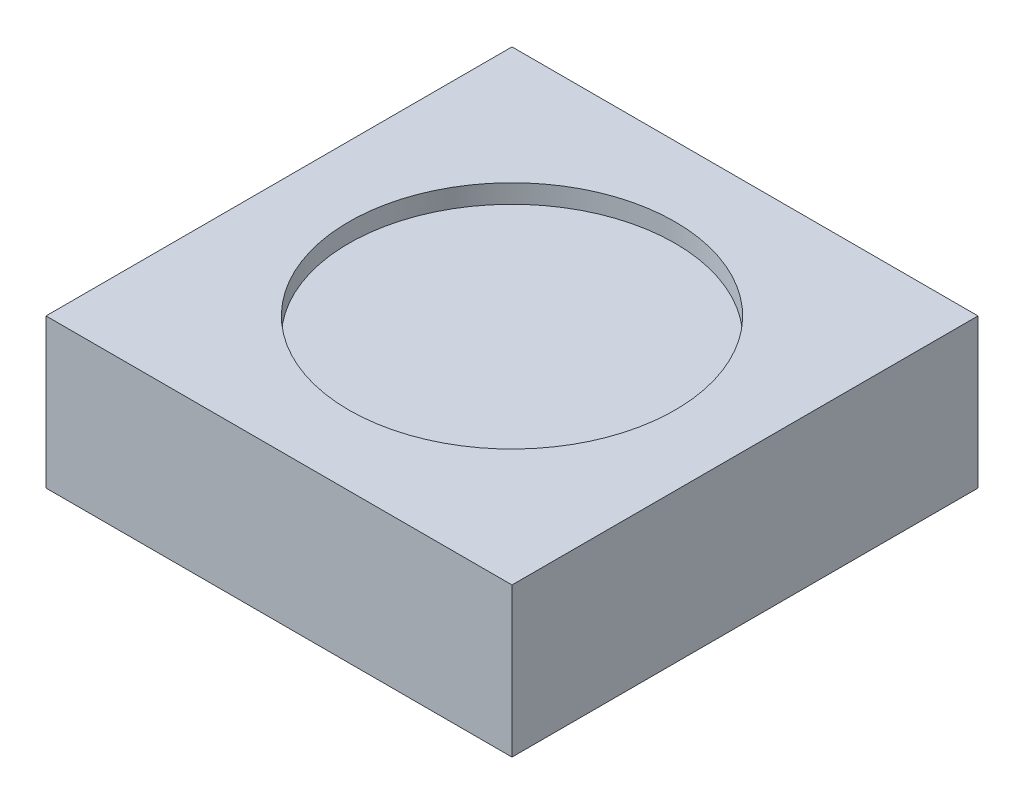
ISO-10303-21;
HEADER;
FILE_DESCRIPTION(('STEP AP214'),'2;1');
FILE_NAME('part.step','',(''),(''),'','','');
FILE_SCHEMA(('AUTOMOTIVE_DESIGN { 1 0 10303 214 1 1 1 1 }'));
ENDSEC;
DATA;
#1=APPLICATION_CONTEXT('core data for automotive mechanical design processes');
#2=APPLICATION_PROTOCOL_DEFINITION('international standard','automotive_design',2000,#1);
#3=PRODUCT_CONTEXT('',#1,'mechanical');
#4=PRODUCT('Part','Part','',(#3));
#5=PRODUCT_RELATED_PRODUCT_CATEGORY('part','',(#4));
#6=PRODUCT_DEFINITION_FORMATION('','',#4);
#7=PRODUCT_DEFINITION_CONTEXT('part definition',#1,'design');
#8=PRODUCT_DEFINITION('design','',#6,#7);
#9=PRODUCT_DEFINITION_SHAPE('','',#8);
#10=(LENGTH_UNIT() NAMED_UNIT(*) SI_UNIT(.MILLI.,.METRE.));
#11=(NAMED_UNIT(*) PLANE_ANGLE_UNIT() SI_UNIT($,.RADIAN.));
#12=(NAMED_UNIT(*) SI_UNIT($,.STERADIAN.) SOLID_ANGLE_UNIT());
#13=UNCERTAINTY_MEASURE_WITH_UNIT(LENGTH_MEASURE(1.E-05),#10,'distance_accuracy_value','');
#14=(GEOMETRIC_REPRESENTATION_CONTEXT(3) GLOBAL_UNCERTAINTY_ASSIGNED_CONTEXT((#13)) GLOBAL_UNIT_ASSIGNED_CONTEXT((#10,
#11,#12)) REPRESENTATION_CONTEXT('',''));
#15=CARTESIAN_POINT('',(0.,0.,0.));
#16=DIRECTION('',(0.,0.,1.));
#17=DIRECTION('',(1.,0.,0.));
#18=AXIS2_PLACEMENT_3D('',#15,#16,#17);
#19=CARTESIAN_POINT('',(2.5,1.6,2.5));
#20=DIRECTION('',(-1.,0.,0.));
#21=DIRECTION('',(0.,0.,1.));
#22=AXIS2_PLACEMENT_3D('',#19,#20,#21);
#23=PLANE('',#22);
#24=DIRECTION('',(0.,0.,-1.));
#25=VECTOR('',#24,1.);
#26=CARTESIAN_POINT('',(2.5,0.,2.5));
#27=LINE('',#26,#25);
#28=CARTESIAN_POINT('',(2.5,0.,2.5));
#29=VERTEX_POINT('',#28);
#30=CARTESIAN_POINT('',(2.5,0.,-2.5));
#31=VERTEX_POINT('',#30);
#32=EDGE_CURVE('E107',#29,#31,#27,.T.);
#33=ORIENTED_EDGE('',*,*,#32,.T.);
#34=DIRECTION('',(0.,-1.,0.));
#35=VECTOR('',#34,1.);
#36=CARTESIAN_POINT('',(2.5,1.6,-2.5));
#37=LINE('',#36,#35);
#38=CARTESIAN_POINT('',(2.5,1.6,-2.5));
#39=VERTEX_POINT('',#38);
#40=EDGE_CURVE('E11',#39,#31,#37,.T.);
#41=ORIENTED_EDGE('',*,*,#40,.F.);
#42=DIRECTION('',(0.,0.,-1.));
#43=VECTOR('',#42,1.);
#44=CARTESIAN_POINT('',(2.5,1.6,2.5));
#45=LINE('',#44,#43);
#46=CARTESIAN_POINT('',(2.5,1.6,2.5));
#47=VERTEX_POINT('',#46);
#48=EDGE_CURVE('E91',#47,#39,#45,.T.);
#49=ORIENTED_EDGE('',*,*,#48,.F.);
#50=DIRECTION('',(0.,-1.,0.));
#51=VECTOR('',#50,1.);
#52=CARTESIAN_POINT('',(2.5,1.6,2.5));
#53=LINE('',#52,#51);
#54=EDGE_CURVE('E103',#47,#29,#53,.T.);
#55=ORIENTED_EDGE('',*,*,#54,.T.);
#56=EDGE_LOOP('',(#33,#41,#49,#55));
#57=FACE_BOUND('',#56,.T.);
#58=ADVANCED_FACE('F39',(#57),#23,.F.);
#59=CARTESIAN_POINT('',(-2.5,1.6,-2.5));
#60=DIRECTION('',(0.,0.,1.));
#61=DIRECTION('',(1.,0.,0.));
#62=AXIS2_PLACEMENT_3D('',#59,#60,#61);
#63=PLANE('',#62);
#64=DIRECTION('',(-1.,0.,0.));
#65=VECTOR('',#64,1.);
#66=CARTESIAN_POINT('',(-2.5,0.,-2.5));
#67=LINE('',#66,#65);
#68=CARTESIAN_POINT('',(-2.5,0.,-2.5));
#69=VERTEX_POINT('',#68);
#70=EDGE_CURVE('E96',#31,#69,#67,.T.);
#71=ORIENTED_EDGE('',*,*,#70,.T.);
#72=DIRECTION('',(0.,-1.,0.));
#73=VECTOR('',#72,1.);
#74=CARTESIAN_POINT('',(-2.5,1.6,-2.5));
#75=LINE('',#74,#73);
#76=CARTESIAN_POINT('',(-2.5,1.6,-2.5));
#77=VERTEX_POINT('',#76);
#78=EDGE_CURVE('E48',#77,#69,#75,.T.);
#79=ORIENTED_EDGE('',*,*,#78,.F.);
#80=DIRECTION('',(-1.,0.,0.));
#81=VECTOR('',#80,1.);
#82=CARTESIAN_POINT('',(-2.5,1.6,-2.5));
#83=LINE('',#82,#81);
#84=EDGE_CURVE('E86',#39,#77,#83,.T.);
#85=ORIENTED_EDGE('',*,*,#84,.F.);
#86=ORIENTED_EDGE('',*,*,#40,.T.);
#87=EDGE_LOOP('',(#71,#79,#85,#86));
#88=FACE_BOUND('',#87,.T.);
#89=ADVANCED_FACE('F95',(#88),#63,.F.);
#90=CARTESIAN_POINT('',(-2.5,1.6,2.5));
#91=DIRECTION('',(1.,0.,0.));
#92=DIRECTION('',(0.,0.,-1.));
#93=AXIS2_PLACEMENT_3D('',#90,#91,#92);
#94=PLANE('',#93);
#95=DIRECTION('',(0.,0.,1.));
#96=VECTOR('',#95,1.);
#97=CARTESIAN_POINT('',(-2.5,0.,2.5));
#98=LINE('',#97,#96);
#99=CARTESIAN_POINT('',(-2.5,0.,2.5));
#100=VERTEX_POINT('',#99);
#101=EDGE_CURVE('E73',#69,#100,#98,.T.);
#102=ORIENTED_EDGE('',*,*,#101,.T.);
#103=DIRECTION('',(0.,-1.,0.));
#104=VECTOR('',#103,1.);
#105=CARTESIAN_POINT('',(-2.5,1.6,2.5));
#106=LINE('',#105,#104);
#107=CARTESIAN_POINT('',(-2.5,1.6,2.5));
#108=VERTEX_POINT('',#107);
#109=EDGE_CURVE('E98',#108,#100,#106,.T.);
#110=ORIENTED_EDGE('',*,*,#109,.F.);
#111=DIRECTION('',(0.,0.,1.));
#112=VECTOR('',#111,1.);
#113=CARTESIAN_POINT('',(-2.5,1.6,2.5));
#114=LINE('',#113,#112);
#115=EDGE_CURVE('E89',#77,#108,#114,.T.);
#116=ORIENTED_EDGE('',*,*,#115,.F.);
#117=ORIENTED_EDGE('',*,*,#78,.T.);
#118=EDGE_LOOP('',(#102,#110,#116,#117));
#119=FACE_BOUND('',#118,.T.);
#120=ADVANCED_FACE('F99',(#119),#94,.F.);
#121=CARTESIAN_POINT('',(-2.5,1.6,2.5));
#122=DIRECTION('',(0.,0.,-1.));
#123=DIRECTION('',(-1.,0.,0.));
#124=AXIS2_PLACEMENT_3D('',#121,#122,#123);
#125=PLANE('',#124);
#126=DIRECTION('',(1.,0.,0.));
#127=VECTOR('',#126,1.);
#128=CARTESIAN_POINT('',(-2.5,0.,2.5));
#129=LINE('',#128,#127);
#130=EDGE_CURVE('E79',#100,#29,#129,.T.);
#131=ORIENTED_EDGE('',*,*,#130,.T.);
#132=ORIENTED_EDGE('',*,*,#54,.F.);
#133=DIRECTION('',(1.,0.,0.));
#134=VECTOR('',#133,1.);
#135=CARTESIAN_POINT('',(-2.5,1.6,2.5));
#136=LINE('',#135,#134);
#137=EDGE_CURVE('E56',#108,#47,#136,.T.);
#138=ORIENTED_EDGE('',*,*,#137,.F.);
#139=ORIENTED_EDGE('',*,*,#109,.T.);
#140=EDGE_LOOP('',(#131,#132,#138,#139));
#141=FACE_BOUND('',#140,.T.);
#142=ADVANCED_FACE('F121',(#141),#125,.F.);
#143=CARTESIAN_POINT('',(0.,1.6,0.));
#144=DIRECTION('',(0.,-1.,0.));
#145=DIRECTION('',(0.,0.,-1.));
#146=AXIS2_PLACEMENT_3D('',#143,#144,#145);
#147=PLANE('',#146);
#148=CARTESIAN_POINT('',(0.,1.6,0.));
#149=DIRECTION('',(0.,1.,0.));
#150=DIRECTION('',(0.,0.,1.));
#151=AXIS2_PLACEMENT_3D('',#148,#149,#150);
#152=CIRCLE('',#151,1.75);
#153=CARTESIAN_POINT('',(0.,1.6,1.75));
#154=VERTEX_POINT('',#153);
#155=EDGE_CURVE('E128',#154,#154,#152,.T.);
#156=ORIENTED_EDGE('',*,*,#155,.F.);
#157=EDGE_LOOP('',(#156));
#158=FACE_BOUND('',#157,.T.);
#159=ORIENTED_EDGE('',*,*,#48,.T.);
#160=ORIENTED_EDGE('',*,*,#84,.T.);
#161=ORIENTED_EDGE('',*,*,#115,.T.);
#162=ORIENTED_EDGE('',*,*,#137,.T.);
#163=EDGE_LOOP('',(#159,#160,#161,#162));
#164=FACE_BOUND('',#163,.T.);
#165=ADVANCED_FACE('F87',(#158,#164),#147,.F.);
#166=CARTESIAN_POINT('',(0.,0.,0.));
#167=DIRECTION('',(0.,-1.,0.));
#168=DIRECTION('',(0.,0.,-1.));
#169=AXIS2_PLACEMENT_3D('',#166,#167,#168);
#170=PLANE('',#169);
#171=ORIENTED_EDGE('',*,*,#32,.F.);
#172=ORIENTED_EDGE('',*,*,#130,.F.);
#173=ORIENTED_EDGE('',*,*,#101,.F.);
#174=ORIENTED_EDGE('',*,*,#70,.F.);
#175=EDGE_LOOP('',(#171,#172,#173,#174));
#176=FACE_BOUND('',#175,.T.);
#177=ADVANCED_FACE('F124',(#176),#170,.T.);
#178=CARTESIAN_POINT('',(0.,1.4,0.));
#179=DIRECTION('',(0.,1.,0.));
#180=DIRECTION('',(0.,0.,1.));
#181=AXIS2_PLACEMENT_3D('',#178,#179,#180);
#182=CYLINDRICAL_SURFACE('',#181,1.75);
#183=CARTESIAN_POINT('',(0.,1.4,0.));
#184=DIRECTION('',(0.,1.,0.));
#185=DIRECTION('',(0.,0.,1.));
#186=AXIS2_PLACEMENT_3D('',#183,#184,#185);
#187=CIRCLE('',#186,1.75);
#188=CARTESIAN_POINT('',(0.,1.4,1.75));
#189=VERTEX_POINT('',#188);
#190=EDGE_CURVE('E111',#189,#189,#187,.T.);
#191=ORIENTED_EDGE('',*,*,#190,.F.);
#192=EDGE_LOOP('',(#191));
#193=FACE_BOUND('',#192,.T.);
#194=ORIENTED_EDGE('',*,*,#155,.T.);
#195=EDGE_LOOP('',(#194));
#196=FACE_BOUND('',#195,.T.);
#197=ADVANCED_FACE('F138',(#193,#196),#182,.F.);
#198=CARTESIAN_POINT('',(0.,1.4,0.));
#199=DIRECTION('',(0.,1.,0.));
#200=DIRECTION('',(0.,0.,1.));
#201=AXIS2_PLACEMENT_3D('',#198,#199,#200);
#202=PLANE('',#201);
#203=ORIENTED_EDGE('',*,*,#190,.T.);
#204=EDGE_LOOP('',(#203));
#205=FACE_BOUND('',#204,.T.);
#206=ADVANCED_FACE('F136',(#205),#202,.T.);
#207=CLOSED_SHELL('',(#58,#89,#120,#142,#165,#177,#197,#206));
#208=MANIFOLD_SOLID_BREP('B2',#207);
#209=ADVANCED_BREP_SHAPE_REPRESENTATION('',(#18,#208),#14);
#210=SHAPE_DEFINITION_REPRESENTATION(#9,#209);
ENDSEC;
END-ISO-10303-21;
